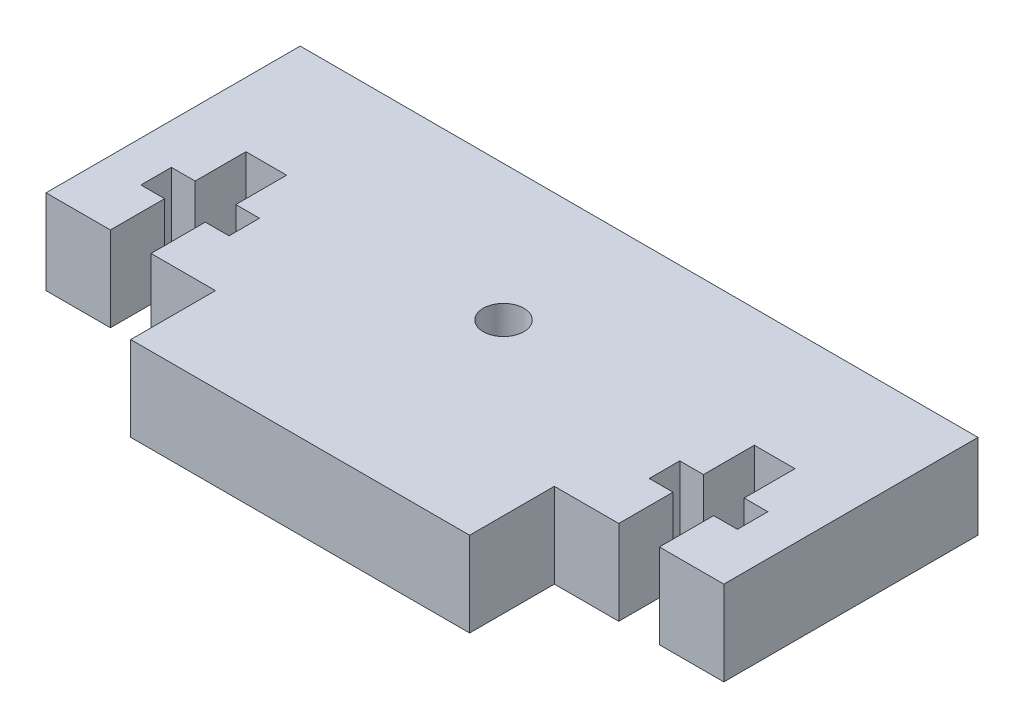
ISO-10303-21;
HEADER;
FILE_DESCRIPTION(('STEP AP214'),'2;1');
FILE_NAME('part.step','',(''),(''),'','','');
FILE_SCHEMA(('AUTOMOTIVE_DESIGN { 1 0 10303 214 1 1 1 1 }'));
ENDSEC;
DATA;
#1=APPLICATION_CONTEXT('core data for automotive mechanical design processes');
#2=APPLICATION_PROTOCOL_DEFINITION('international standard','automotive_design',2000,#1);
#3=PRODUCT_CONTEXT('',#1,'mechanical');
#4=PRODUCT('Part','Part','',(#3));
#5=PRODUCT_RELATED_PRODUCT_CATEGORY('part','',(#4));
#6=PRODUCT_DEFINITION_FORMATION('','',#4);
#7=PRODUCT_DEFINITION_CONTEXT('part definition',#1,'design');
#8=PRODUCT_DEFINITION('design','',#6,#7);
#9=PRODUCT_DEFINITION_SHAPE('','',#8);
#10=(LENGTH_UNIT() NAMED_UNIT(*) SI_UNIT(.MILLI.,.METRE.));
#11=(NAMED_UNIT(*) PLANE_ANGLE_UNIT() SI_UNIT($,.RADIAN.));
#12=(NAMED_UNIT(*) SI_UNIT($,.STERADIAN.) SOLID_ANGLE_UNIT());
#13=UNCERTAINTY_MEASURE_WITH_UNIT(LENGTH_MEASURE(1.E-05),#10,'distance_accuracy_value','');
#14=(GEOMETRIC_REPRESENTATION_CONTEXT(3) GLOBAL_UNCERTAINTY_ASSIGNED_CONTEXT((#13)) GLOBAL_UNIT_ASSIGNED_CONTEXT((#10,
#11,#12)) REPRESENTATION_CONTEXT('',''));
#15=CARTESIAN_POINT('',(0.,0.,0.));
#16=DIRECTION('',(0.,0.,1.));
#17=DIRECTION('',(1.,0.,0.));
#18=AXIS2_PLACEMENT_3D('',#15,#16,#17);
#19=CARTESIAN_POINT('',(0.,6.35,25.4));
#20=DIRECTION('',(0.,0.,-1.));
#21=DIRECTION('',(-1.,0.,0.));
#22=AXIS2_PLACEMENT_3D('',#19,#20,#21);
#23=PLANE('',#22);
#24=DIRECTION('',(1.,0.,0.));
#25=VECTOR('',#24,1.);
#26=CARTESIAN_POINT('',(0.,0.,25.4));
#27=LINE('',#26,#25);
#28=CARTESIAN_POINT('',(12.7,0.,25.4));
#29=VERTEX_POINT('',#28);
#30=CARTESIAN_POINT('',(38.1,0.,25.4));
#31=VERTEX_POINT('',#30);
#32=EDGE_CURVE('E337',#29,#31,#27,.T.);
#33=ORIENTED_EDGE('',*,*,#32,.T.);
#34=DIRECTION('',(0.,-1.,0.));
#35=VECTOR('',#34,1.);
#36=CARTESIAN_POINT('',(38.1,6.35,25.4));
#37=LINE('',#36,#35);
#38=CARTESIAN_POINT('',(38.1,6.35,25.4));
#39=VERTEX_POINT('',#38);
#40=EDGE_CURVE('E11',#39,#31,#37,.T.);
#41=ORIENTED_EDGE('',*,*,#40,.F.);
#42=DIRECTION('',(1.,0.,0.));
#43=VECTOR('',#42,1.);
#44=CARTESIAN_POINT('',(0.,6.35,25.4));
#45=LINE('',#44,#43);
#46=CARTESIAN_POINT('',(12.7,6.35,25.4));
#47=VERTEX_POINT('',#46);
#48=EDGE_CURVE('E329',#47,#39,#45,.T.);
#49=ORIENTED_EDGE('',*,*,#48,.F.);
#50=DIRECTION('',(0.,-1.,0.));
#51=VECTOR('',#50,1.);
#52=CARTESIAN_POINT('',(12.7,6.35,25.4));
#53=LINE('',#52,#51);
#54=EDGE_CURVE('E48',#47,#29,#53,.T.);
#55=ORIENTED_EDGE('',*,*,#54,.T.);
#56=EDGE_LOOP('',(#33,#41,#49,#55));
#57=FACE_BOUND('',#56,.T.);
#58=ADVANCED_FACE('F32',(#57),#23,.F.);
#59=CARTESIAN_POINT('',(38.1,6.35,0.));
#60=DIRECTION('',(-1.,0.,0.));
#61=DIRECTION('',(0.,0.,1.));
#62=AXIS2_PLACEMENT_3D('',#59,#60,#61);
#63=PLANE('',#62);
#64=DIRECTION('',(0.,0.,-1.));
#65=VECTOR('',#64,1.);
#66=CARTESIAN_POINT('',(38.1,0.,0.));
#67=LINE('',#66,#65);
#68=CARTESIAN_POINT('',(38.1,0.,19.05));
#69=VERTEX_POINT('',#68);
#70=EDGE_CURVE('E340',#31,#69,#67,.T.);
#71=ORIENTED_EDGE('',*,*,#70,.T.);
#72=DIRECTION('',(0.,-1.,0.));
#73=VECTOR('',#72,1.);
#74=CARTESIAN_POINT('',(38.1,6.35,19.05));
#75=LINE('',#74,#73);
#76=CARTESIAN_POINT('',(38.1,6.35,19.05));
#77=VERTEX_POINT('',#76);
#78=EDGE_CURVE('E40',#77,#69,#75,.T.);
#79=ORIENTED_EDGE('',*,*,#78,.F.);
#80=DIRECTION('',(0.,0.,-1.));
#81=VECTOR('',#80,1.);
#82=CARTESIAN_POINT('',(38.1,6.35,0.));
#83=LINE('',#82,#81);
#84=EDGE_CURVE('E159',#39,#77,#83,.T.);
#85=ORIENTED_EDGE('',*,*,#84,.F.);
#86=ORIENTED_EDGE('',*,*,#40,.T.);
#87=EDGE_LOOP('',(#71,#79,#85,#86));
#88=FACE_BOUND('',#87,.T.);
#89=ADVANCED_FACE('F475',(#88),#63,.F.);
#90=CARTESIAN_POINT('',(0.,6.35,19.05));
#91=DIRECTION('',(0.,0.,1.));
#92=DIRECTION('',(1.,0.,0.));
#93=AXIS2_PLACEMENT_3D('',#90,#91,#92);
#94=PLANE('',#93);
#95=DIRECTION('',(-1.,0.,0.));
#96=VECTOR('',#95,1.);
#97=CARTESIAN_POINT('',(0.,0.,19.05));
#98=LINE('',#97,#96);
#99=CARTESIAN_POINT('',(42.926,0.,19.05));
#100=VERTEX_POINT('',#99);
#101=EDGE_CURVE('E344',#100,#69,#98,.T.);
#102=ORIENTED_EDGE('',*,*,#101,.F.);
#103=DIRECTION('',(0.,-1.,0.));
#104=VECTOR('',#103,1.);
#105=CARTESIAN_POINT('',(42.926,6.35,19.05));
#106=LINE('',#105,#104);
#107=CARTESIAN_POINT('',(42.926,6.35,19.05));
#108=VERTEX_POINT('',#107);
#109=EDGE_CURVE('E470',#108,#100,#106,.T.);
#110=ORIENTED_EDGE('',*,*,#109,.F.);
#111=DIRECTION('',(-1.,0.,0.));
#112=VECTOR('',#111,1.);
#113=CARTESIAN_POINT('',(0.,6.35,19.05));
#114=LINE('',#113,#112);
#115=EDGE_CURVE('E325',#108,#77,#114,.T.);
#116=ORIENTED_EDGE('',*,*,#115,.T.);
#117=ORIENTED_EDGE('',*,*,#78,.T.);
#118=EDGE_LOOP('',(#102,#110,#116,#117));
#119=FACE_BOUND('',#118,.T.);
#120=ADVANCED_FACE('F473',(#119),#94,.T.);
#121=CARTESIAN_POINT('',(42.926,6.35,0.));
#122=DIRECTION('',(-1.,0.,0.));
#123=DIRECTION('',(0.,0.,1.));
#124=AXIS2_PLACEMENT_3D('',#121,#122,#123);
#125=PLANE('',#124);
#126=DIRECTION('',(0.,0.,-1.));
#127=VECTOR('',#126,1.);
#128=CARTESIAN_POINT('',(42.926,0.,0.));
#129=LINE('',#128,#127);
#130=CARTESIAN_POINT('',(42.926,0.,14.986));
#131=VERTEX_POINT('',#130);
#132=EDGE_CURVE('E350',#100,#131,#129,.T.);
#133=ORIENTED_EDGE('',*,*,#132,.T.);
#134=DIRECTION('',(0.,-1.,0.));
#135=VECTOR('',#134,1.);
#136=CARTESIAN_POINT('',(42.926,6.35,14.986));
#137=LINE('',#136,#135);
#138=CARTESIAN_POINT('',(42.926,6.35,14.986));
#139=VERTEX_POINT('',#138);
#140=EDGE_CURVE('E468',#139,#131,#137,.T.);
#141=ORIENTED_EDGE('',*,*,#140,.F.);
#142=DIRECTION('',(0.,0.,-1.));
#143=VECTOR('',#142,1.);
#144=CARTESIAN_POINT('',(42.926,6.35,0.));
#145=LINE('',#144,#143);
#146=EDGE_CURVE('E323',#108,#139,#145,.T.);
#147=ORIENTED_EDGE('',*,*,#146,.F.);
#148=ORIENTED_EDGE('',*,*,#109,.T.);
#149=EDGE_LOOP('',(#133,#141,#147,#148));
#150=FACE_BOUND('',#149,.T.);
#151=ADVANCED_FACE('F482',(#150),#125,.F.);
#152=CARTESIAN_POINT('',(0.,6.35,14.986));
#153=DIRECTION('',(0.,0.,-1.));
#154=DIRECTION('',(-1.,0.,0.));
#155=AXIS2_PLACEMENT_3D('',#152,#153,#154);
#156=PLANE('',#155);
#157=DIRECTION('',(1.,0.,0.));
#158=VECTOR('',#157,1.);
#159=CARTESIAN_POINT('',(0.,0.,14.986));
#160=LINE('',#159,#158);
#161=CARTESIAN_POINT('',(41.148,0.,14.986));
#162=VERTEX_POINT('',#161);
#163=EDGE_CURVE('E354',#162,#131,#160,.T.);
#164=ORIENTED_EDGE('',*,*,#163,.F.);
#165=DIRECTION('',(0.,-1.,0.));
#166=VECTOR('',#165,1.);
#167=CARTESIAN_POINT('',(41.148,6.35,14.986));
#168=LINE('',#167,#166);
#169=CARTESIAN_POINT('',(41.148,6.35,14.986));
#170=VERTEX_POINT('',#169);
#171=EDGE_CURVE('E466',#170,#162,#168,.T.);
#172=ORIENTED_EDGE('',*,*,#171,.F.);
#173=DIRECTION('',(1.,0.,0.));
#174=VECTOR('',#173,1.);
#175=CARTESIAN_POINT('',(0.,6.35,14.986));
#176=LINE('',#175,#174);
#177=EDGE_CURVE('E320',#170,#139,#176,.T.);
#178=ORIENTED_EDGE('',*,*,#177,.T.);
#179=ORIENTED_EDGE('',*,*,#140,.T.);
#180=EDGE_LOOP('',(#164,#172,#178,#179));
#181=FACE_BOUND('',#180,.T.);
#182=ADVANCED_FACE('F499',(#181),#156,.T.);
#183=CARTESIAN_POINT('',(41.148,6.35,0.));
#184=DIRECTION('',(1.,0.,0.));
#185=DIRECTION('',(0.,0.,-1.));
#186=AXIS2_PLACEMENT_3D('',#183,#184,#185);
#187=PLANE('',#186);
#188=DIRECTION('',(0.,0.,1.));
#189=VECTOR('',#188,1.);
#190=CARTESIAN_POINT('',(41.148,0.,0.));
#191=LINE('',#190,#189);
#192=CARTESIAN_POINT('',(41.148,0.,12.7));
#193=VERTEX_POINT('',#192);
#194=EDGE_CURVE('E358',#193,#162,#191,.T.);
#195=ORIENTED_EDGE('',*,*,#194,.F.);
#196=DIRECTION('',(0.,-1.,0.));
#197=VECTOR('',#196,1.);
#198=CARTESIAN_POINT('',(41.148,6.35,12.7));
#199=LINE('',#198,#197);
#200=CARTESIAN_POINT('',(41.148,6.35,12.7));
#201=VERTEX_POINT('',#200);
#202=EDGE_CURVE('E464',#201,#193,#199,.T.);
#203=ORIENTED_EDGE('',*,*,#202,.F.);
#204=DIRECTION('',(0.,0.,1.));
#205=VECTOR('',#204,1.);
#206=CARTESIAN_POINT('',(41.148,6.35,0.));
#207=LINE('',#206,#205);
#208=EDGE_CURVE('E317',#201,#170,#207,.T.);
#209=ORIENTED_EDGE('',*,*,#208,.T.);
#210=ORIENTED_EDGE('',*,*,#171,.T.);
#211=EDGE_LOOP('',(#195,#203,#209,#210));
#212=FACE_BOUND('',#211,.T.);
#213=ADVANCED_FACE('F495',(#212),#187,.T.);
#214=CARTESIAN_POINT('',(0.,6.35,12.7));
#215=DIRECTION('',(0.,0.,-1.));
#216=DIRECTION('',(-1.,0.,0.));
#217=AXIS2_PLACEMENT_3D('',#214,#215,#216);
#218=PLANE('',#217);
#219=DIRECTION('',(1.,0.,0.));
#220=VECTOR('',#219,1.);
#221=CARTESIAN_POINT('',(0.,0.,12.7));
#222=LINE('',#221,#220);
#223=CARTESIAN_POINT('',(42.926,0.,12.7));
#224=VERTEX_POINT('',#223);
#225=EDGE_CURVE('E362',#193,#224,#222,.T.);
#226=ORIENTED_EDGE('',*,*,#225,.T.);
#227=DIRECTION('',(0.,-1.,0.));
#228=VECTOR('',#227,1.);
#229=CARTESIAN_POINT('',(42.926,6.35,12.7));
#230=LINE('',#229,#228);
#231=CARTESIAN_POINT('',(42.926,6.35,12.7));
#232=VERTEX_POINT('',#231);
#233=EDGE_CURVE('E461',#232,#224,#230,.T.);
#234=ORIENTED_EDGE('',*,*,#233,.F.);
#235=DIRECTION('',(1.,0.,0.));
#236=VECTOR('',#235,1.);
#237=CARTESIAN_POINT('',(0.,6.35,12.7));
#238=LINE('',#237,#236);
#239=EDGE_CURVE('E315',#201,#232,#238,.T.);
#240=ORIENTED_EDGE('',*,*,#239,.F.);
#241=ORIENTED_EDGE('',*,*,#202,.T.);
#242=EDGE_LOOP('',(#226,#234,#240,#241));
#243=FACE_BOUND('',#242,.T.);
#244=ADVANCED_FACE('F498',(#243),#218,.F.);
#245=CARTESIAN_POINT('',(42.926,0.,8.89));
#246=VERTEX_POINT('',#245);
#247=EDGE_CURVE('E355',#224,#246,#129,.T.);
#248=ORIENTED_EDGE('',*,*,#247,.T.);
#249=DIRECTION('',(0.,-1.,0.));
#250=VECTOR('',#249,1.);
#251=CARTESIAN_POINT('',(42.926,6.35,8.89));
#252=LINE('',#251,#250);
#253=CARTESIAN_POINT('',(42.926,6.35,8.89));
#254=VERTEX_POINT('',#253);
#255=EDGE_CURVE('E458',#254,#246,#252,.T.);
#256=ORIENTED_EDGE('',*,*,#255,.F.);
#257=EDGE_CURVE('E314',#232,#254,#145,.T.);
#258=ORIENTED_EDGE('',*,*,#257,.F.);
#259=ORIENTED_EDGE('',*,*,#233,.T.);
#260=EDGE_LOOP('',(#248,#256,#258,#259));
#261=FACE_BOUND('',#260,.T.);
#262=ADVANCED_FACE('F501',(#261),#125,.F.);
#263=CARTESIAN_POINT('',(0.,6.35,8.89));
#264=DIRECTION('',(0.,0.,-1.));
#265=DIRECTION('',(-1.,0.,0.));
#266=AXIS2_PLACEMENT_3D('',#263,#264,#265);
#267=PLANE('',#266);
#268=DIRECTION('',(1.,0.,0.));
#269=VECTOR('',#268,1.);
#270=CARTESIAN_POINT('',(0.,0.,8.89));
#271=LINE('',#270,#269);
#272=CARTESIAN_POINT('',(45.974,0.,8.89));
#273=VERTEX_POINT('',#272);
#274=EDGE_CURVE('E365',#246,#273,#271,.T.);
#275=ORIENTED_EDGE('',*,*,#274,.T.);
#276=DIRECTION('',(0.,-1.,0.));
#277=VECTOR('',#276,1.);
#278=CARTESIAN_POINT('',(45.974,6.35,8.89));
#279=LINE('',#278,#277);
#280=CARTESIAN_POINT('',(45.974,6.35,8.89));
#281=VERTEX_POINT('',#280);
#282=EDGE_CURVE('E456',#281,#273,#279,.T.);
#283=ORIENTED_EDGE('',*,*,#282,.F.);
#284=DIRECTION('',(1.,0.,0.));
#285=VECTOR('',#284,1.);
#286=CARTESIAN_POINT('',(0.,6.35,8.89));
#287=LINE('',#286,#285);
#288=EDGE_CURVE('E311',#254,#281,#287,.T.);
#289=ORIENTED_EDGE('',*,*,#288,.F.);
#290=ORIENTED_EDGE('',*,*,#255,.T.);
#291=EDGE_LOOP('',(#275,#283,#289,#290));
#292=FACE_BOUND('',#291,.T.);
#293=ADVANCED_FACE('F504',(#292),#267,.F.);
#294=CARTESIAN_POINT('',(45.974,6.35,0.));
#295=DIRECTION('',(-1.,0.,0.));
#296=DIRECTION('',(0.,0.,1.));
#297=AXIS2_PLACEMENT_3D('',#294,#295,#296);
#298=PLANE('',#297);
#299=DIRECTION('',(0.,0.,-1.));
#300=VECTOR('',#299,1.);
#301=CARTESIAN_POINT('',(45.974,0.,0.));
#302=LINE('',#301,#300);
#303=CARTESIAN_POINT('',(45.974,0.,12.7));
#304=VERTEX_POINT('',#303);
#305=EDGE_CURVE('E368',#304,#273,#302,.T.);
#306=ORIENTED_EDGE('',*,*,#305,.F.);
#307=DIRECTION('',(0.,-1.,0.));
#308=VECTOR('',#307,1.);
#309=CARTESIAN_POINT('',(45.974,6.35,12.7));
#310=LINE('',#309,#308);
#311=CARTESIAN_POINT('',(45.974,6.35,12.7));
#312=VERTEX_POINT('',#311);
#313=EDGE_CURVE('E454',#312,#304,#310,.T.);
#314=ORIENTED_EDGE('',*,*,#313,.F.);
#315=DIRECTION('',(0.,0.,-1.));
#316=VECTOR('',#315,1.);
#317=CARTESIAN_POINT('',(45.974,6.35,0.));
#318=LINE('',#317,#316);
#319=EDGE_CURVE('E308',#312,#281,#318,.T.);
#320=ORIENTED_EDGE('',*,*,#319,.T.);
#321=ORIENTED_EDGE('',*,*,#282,.T.);
#322=EDGE_LOOP('',(#306,#314,#320,#321));
#323=FACE_BOUND('',#322,.T.);
#324=ADVANCED_FACE('F508',(#323),#298,.T.);
#325=CARTESIAN_POINT('',(47.752,0.,12.7));
#326=VERTEX_POINT('',#325);
#327=EDGE_CURVE('E364',#304,#326,#222,.T.);
#328=ORIENTED_EDGE('',*,*,#327,.T.);
#329=DIRECTION('',(0.,-1.,0.));
#330=VECTOR('',#329,1.);
#331=CARTESIAN_POINT('',(47.752,6.35,12.7));
#332=LINE('',#331,#330);
#333=CARTESIAN_POINT('',(47.752,6.35,12.7));
#334=VERTEX_POINT('',#333);
#335=EDGE_CURVE('E451',#334,#326,#332,.T.);
#336=ORIENTED_EDGE('',*,*,#335,.F.);
#337=EDGE_CURVE('E307',#312,#334,#238,.T.);
#338=ORIENTED_EDGE('',*,*,#337,.F.);
#339=ORIENTED_EDGE('',*,*,#313,.T.);
#340=EDGE_LOOP('',(#328,#336,#338,#339));
#341=FACE_BOUND('',#340,.T.);
#342=ADVANCED_FACE('F510',(#341),#218,.F.);
#343=CARTESIAN_POINT('',(47.752,6.35,0.));
#344=DIRECTION('',(1.,0.,0.));
#345=DIRECTION('',(0.,0.,-1.));
#346=AXIS2_PLACEMENT_3D('',#343,#344,#345);
#347=PLANE('',#346);
#348=DIRECTION('',(0.,0.,1.));
#349=VECTOR('',#348,1.);
#350=CARTESIAN_POINT('',(47.752,0.,0.));
#351=LINE('',#350,#349);
#352=CARTESIAN_POINT('',(47.752,0.,14.986));
#353=VERTEX_POINT('',#352);
#354=EDGE_CURVE('E372',#326,#353,#351,.T.);
#355=ORIENTED_EDGE('',*,*,#354,.T.);
#356=DIRECTION('',(0.,-1.,0.));
#357=VECTOR('',#356,1.);
#358=CARTESIAN_POINT('',(47.752,6.35,14.986));
#359=LINE('',#358,#357);
#360=CARTESIAN_POINT('',(47.752,6.35,14.986));
#361=VERTEX_POINT('',#360);
#362=EDGE_CURVE('E449',#361,#353,#359,.T.);
#363=ORIENTED_EDGE('',*,*,#362,.F.);
#364=DIRECTION('',(0.,0.,1.));
#365=VECTOR('',#364,1.);
#366=CARTESIAN_POINT('',(47.752,6.35,0.));
#367=LINE('',#366,#365);
#368=EDGE_CURVE('E304',#334,#361,#367,.T.);
#369=ORIENTED_EDGE('',*,*,#368,.F.);
#370=ORIENTED_EDGE('',*,*,#335,.T.);
#371=EDGE_LOOP('',(#355,#363,#369,#370));
#372=FACE_BOUND('',#371,.T.);
#373=ADVANCED_FACE('F513',(#372),#347,.F.);
#374=CARTESIAN_POINT('',(45.974,0.,14.986));
#375=VERTEX_POINT('',#374);
#376=EDGE_CURVE('E359',#375,#353,#160,.T.);
#377=ORIENTED_EDGE('',*,*,#376,.F.);
#378=DIRECTION('',(0.,-1.,0.));
#379=VECTOR('',#378,1.);
#380=CARTESIAN_POINT('',(45.974,6.35,14.986));
#381=LINE('',#380,#379);
#382=CARTESIAN_POINT('',(45.974,6.35,14.986));
#383=VERTEX_POINT('',#382);
#384=EDGE_CURVE('E447',#383,#375,#381,.T.);
#385=ORIENTED_EDGE('',*,*,#384,.F.);
#386=EDGE_CURVE('E306',#383,#361,#176,.T.);
#387=ORIENTED_EDGE('',*,*,#386,.T.);
#388=ORIENTED_EDGE('',*,*,#362,.T.);
#389=EDGE_LOOP('',(#377,#385,#387,#388));
#390=FACE_BOUND('',#389,.T.);
#391=ADVANCED_FACE('F517',(#390),#156,.T.);
#392=CARTESIAN_POINT('',(45.974,0.,19.05));
#393=VERTEX_POINT('',#392);
#394=EDGE_CURVE('E371',#393,#375,#302,.T.);
#395=ORIENTED_EDGE('',*,*,#394,.F.);
#396=DIRECTION('',(0.,-1.,0.));
#397=VECTOR('',#396,1.);
#398=CARTESIAN_POINT('',(45.974,6.35,19.05));
#399=LINE('',#398,#397);
#400=CARTESIAN_POINT('',(45.974,6.35,19.05));
#401=VERTEX_POINT('',#400);
#402=EDGE_CURVE('E445',#401,#393,#399,.T.);
#403=ORIENTED_EDGE('',*,*,#402,.F.);
#404=EDGE_CURVE('E312',#401,#383,#318,.T.);
#405=ORIENTED_EDGE('',*,*,#404,.T.);
#406=ORIENTED_EDGE('',*,*,#384,.T.);
#407=EDGE_LOOP('',(#395,#403,#405,#406));
#408=FACE_BOUND('',#407,.T.);
#409=ADVANCED_FACE('F521',(#408),#298,.T.);
#410=CARTESIAN_POINT('',(50.8,0.,19.05));
#411=VERTEX_POINT('',#410);
#412=EDGE_CURVE('E351',#411,#393,#98,.T.);
#413=ORIENTED_EDGE('',*,*,#412,.F.);
#414=DIRECTION('',(0.,-1.,0.));
#415=VECTOR('',#414,1.);
#416=CARTESIAN_POINT('',(50.8,6.35,19.05));
#417=LINE('',#416,#415);
#418=CARTESIAN_POINT('',(50.8,6.35,19.05));
#419=VERTEX_POINT('',#418);
#420=EDGE_CURVE('E443',#419,#411,#417,.T.);
#421=ORIENTED_EDGE('',*,*,#420,.F.);
#422=EDGE_CURVE('E303',#419,#401,#114,.T.);
#423=ORIENTED_EDGE('',*,*,#422,.T.);
#424=ORIENTED_EDGE('',*,*,#402,.T.);
#425=EDGE_LOOP('',(#413,#421,#423,#424));
#426=FACE_BOUND('',#425,.T.);
#427=ADVANCED_FACE('F493',(#426),#94,.T.);
#428=CARTESIAN_POINT('',(50.8,6.35,0.));
#429=DIRECTION('',(1.,0.,0.));
#430=DIRECTION('',(0.,0.,-1.));
#431=AXIS2_PLACEMENT_3D('',#428,#429,#430);
#432=PLANE('',#431);
#433=DIRECTION('',(0.,0.,1.));
#434=VECTOR('',#433,1.);
#435=CARTESIAN_POINT('',(50.8,0.,0.));
#436=LINE('',#435,#434);
#437=CARTESIAN_POINT('',(50.8,0.,0.));
#438=VERTEX_POINT('',#437);
#439=EDGE_CURVE('E375',#438,#411,#436,.T.);
#440=ORIENTED_EDGE('',*,*,#439,.F.);
#441=DIRECTION('',(0.,-1.,0.));
#442=VECTOR('',#441,1.);
#443=CARTESIAN_POINT('',(50.8,6.35,0.));
#444=LINE('',#443,#442);
#445=CARTESIAN_POINT('',(50.8,6.35,0.));
#446=VERTEX_POINT('',#445);
#447=EDGE_CURVE('E441',#446,#438,#444,.T.);
#448=ORIENTED_EDGE('',*,*,#447,.F.);
#449=DIRECTION('',(0.,0.,1.));
#450=VECTOR('',#449,1.);
#451=CARTESIAN_POINT('',(50.8,6.35,0.));
#452=LINE('',#451,#450);
#453=EDGE_CURVE('E300',#446,#419,#452,.T.);
#454=ORIENTED_EDGE('',*,*,#453,.T.);
#455=ORIENTED_EDGE('',*,*,#420,.T.);
#456=EDGE_LOOP('',(#440,#448,#454,#455));
#457=FACE_BOUND('',#456,.T.);
#458=ADVANCED_FACE('F527',(#457),#432,.T.);
#459=CARTESIAN_POINT('',(0.,6.35,0.));
#460=DIRECTION('',(0.,0.,-1.));
#461=DIRECTION('',(-1.,0.,0.));
#462=AXIS2_PLACEMENT_3D('',#459,#460,#461);
#463=PLANE('',#462);
#464=DIRECTION('',(1.,0.,0.));
#465=VECTOR('',#464,1.);
#466=CARTESIAN_POINT('',(0.,0.,0.));
#467=LINE('',#466,#465);
#468=CARTESIAN_POINT('',(0.,0.,0.));
#469=VERTEX_POINT('',#468);
#470=EDGE_CURVE('E378',#469,#438,#467,.T.);
#471=ORIENTED_EDGE('',*,*,#470,.F.);
#472=DIRECTION('',(0.,-1.,0.));
#473=VECTOR('',#472,1.);
#474=CARTESIAN_POINT('',(0.,6.35,0.));
#475=LINE('',#474,#473);
#476=CARTESIAN_POINT('',(0.,6.35,0.));
#477=VERTEX_POINT('',#476);
#478=EDGE_CURVE('E439',#477,#469,#475,.T.);
#479=ORIENTED_EDGE('',*,*,#478,.F.);
#480=DIRECTION('',(1.,0.,0.));
#481=VECTOR('',#480,1.);
#482=CARTESIAN_POINT('',(0.,6.35,0.));
#483=LINE('',#482,#481);
#484=EDGE_CURVE('E297',#477,#446,#483,.T.);
#485=ORIENTED_EDGE('',*,*,#484,.T.);
#486=ORIENTED_EDGE('',*,*,#447,.T.);
#487=EDGE_LOOP('',(#471,#479,#485,#486));
#488=FACE_BOUND('',#487,.T.);
#489=ADVANCED_FACE('F531',(#488),#463,.T.);
#490=CARTESIAN_POINT('',(0.,6.35,0.));
#491=DIRECTION('',(1.,0.,0.));
#492=DIRECTION('',(0.,0.,-1.));
#493=AXIS2_PLACEMENT_3D('',#490,#491,#492);
#494=PLANE('',#493);
#495=DIRECTION('',(0.,0.,1.));
#496=VECTOR('',#495,1.);
#497=CARTESIAN_POINT('',(0.,0.,0.));
#498=LINE('',#497,#496);
#499=CARTESIAN_POINT('',(0.,0.,19.05));
#500=VERTEX_POINT('',#499);
#501=EDGE_CURVE('E381',#469,#500,#498,.T.);
#502=ORIENTED_EDGE('',*,*,#501,.T.);
#503=DIRECTION('',(0.,-1.,0.));
#504=VECTOR('',#503,1.);
#505=CARTESIAN_POINT('',(0.,6.35,19.05));
#506=LINE('',#505,#504);
#507=CARTESIAN_POINT('',(0.,6.35,19.05));
#508=VERTEX_POINT('',#507);
#509=EDGE_CURVE('E436',#508,#500,#506,.T.);
#510=ORIENTED_EDGE('',*,*,#509,.F.);
#511=DIRECTION('',(0.,0.,1.));
#512=VECTOR('',#511,1.);
#513=CARTESIAN_POINT('',(0.,6.35,0.));
#514=LINE('',#513,#512);
#515=EDGE_CURVE('E295',#477,#508,#514,.T.);
#516=ORIENTED_EDGE('',*,*,#515,.F.);
#517=ORIENTED_EDGE('',*,*,#478,.T.);
#518=EDGE_LOOP('',(#502,#510,#516,#517));
#519=FACE_BOUND('',#518,.T.);
#520=ADVANCED_FACE('F535',(#519),#494,.F.);
#521=CARTESIAN_POINT('',(0.,6.35,19.05));
#522=DIRECTION('',(0.,0.,-1.));
#523=DIRECTION('',(-1.,0.,0.));
#524=AXIS2_PLACEMENT_3D('',#521,#522,#523);
#525=PLANE('',#524);
#526=DIRECTION('',(1.,0.,0.));
#527=VECTOR('',#526,1.);
#528=CARTESIAN_POINT('',(0.,0.,19.05));
#529=LINE('',#528,#527);
#530=CARTESIAN_POINT('',(4.826,0.,19.05));
#531=VERTEX_POINT('',#530);
#532=EDGE_CURVE('E383',#500,#531,#529,.T.);
#533=ORIENTED_EDGE('',*,*,#532,.T.);
#534=DIRECTION('',(0.,-1.,0.));
#535=VECTOR('',#534,1.);
#536=CARTESIAN_POINT('',(4.826,6.35,19.05));
#537=LINE('',#536,#535);
#538=CARTESIAN_POINT('',(4.826,6.35,19.05));
#539=VERTEX_POINT('',#538);
#540=EDGE_CURVE('E433',#539,#531,#537,.T.);
#541=ORIENTED_EDGE('',*,*,#540,.F.);
#542=DIRECTION('',(1.,0.,0.));
#543=VECTOR('',#542,1.);
#544=CARTESIAN_POINT('',(0.,6.35,19.05));
#545=LINE('',#544,#543);
#546=EDGE_CURVE('E264',#508,#539,#545,.T.);
#547=ORIENTED_EDGE('',*,*,#546,.F.);
#548=ORIENTED_EDGE('',*,*,#509,.T.);
#549=EDGE_LOOP('',(#533,#541,#547,#548));
#550=FACE_BOUND('',#549,.T.);
#551=ADVANCED_FACE('F539',(#550),#525,.F.);
#552=CARTESIAN_POINT('',(4.826,6.35,0.));
#553=DIRECTION('',(-1.,0.,0.));
#554=DIRECTION('',(0.,0.,1.));
#555=AXIS2_PLACEMENT_3D('',#552,#553,#554);
#556=PLANE('',#555);
#557=DIRECTION('',(0.,0.,-1.));
#558=VECTOR('',#557,1.);
#559=CARTESIAN_POINT('',(4.826,0.,0.));
#560=LINE('',#559,#558);
#561=CARTESIAN_POINT('',(4.826,0.,14.986));
#562=VERTEX_POINT('',#561);
#563=EDGE_CURVE('E385',#531,#562,#560,.T.);
#564=ORIENTED_EDGE('',*,*,#563,.T.);
#565=DIRECTION('',(0.,-1.,0.));
#566=VECTOR('',#565,1.);
#567=CARTESIAN_POINT('',(4.826,6.35,14.986));
#568=LINE('',#567,#566);
#569=CARTESIAN_POINT('',(4.826,6.35,14.986));
#570=VERTEX_POINT('',#569);
#571=EDGE_CURVE('E430',#570,#562,#568,.T.);
#572=ORIENTED_EDGE('',*,*,#571,.F.);
#573=DIRECTION('',(0.,0.,-1.));
#574=VECTOR('',#573,1.);
#575=CARTESIAN_POINT('',(4.826,6.35,0.));
#576=LINE('',#575,#574);
#577=EDGE_CURVE('E289',#539,#570,#576,.T.);
#578=ORIENTED_EDGE('',*,*,#577,.F.);
#579=ORIENTED_EDGE('',*,*,#540,.T.);
#580=EDGE_LOOP('',(#564,#572,#578,#579));
#581=FACE_BOUND('',#580,.T.);
#582=ADVANCED_FACE('F552',(#581),#556,.F.);
#583=CARTESIAN_POINT('',(0.,6.35,14.986));
#584=DIRECTION('',(0.,0.,1.));
#585=DIRECTION('',(1.,0.,0.));
#586=AXIS2_PLACEMENT_3D('',#583,#584,#585);
#587=PLANE('',#586);
#588=DIRECTION('',(-1.,0.,0.));
#589=VECTOR('',#588,1.);
#590=CARTESIAN_POINT('',(0.,0.,14.986));
#591=LINE('',#590,#589);
#592=CARTESIAN_POINT('',(3.04799999999999,0.,14.986));
#593=VERTEX_POINT('',#592);
#594=EDGE_CURVE('E388',#562,#593,#591,.T.);
#595=ORIENTED_EDGE('',*,*,#594,.T.);
#596=DIRECTION('',(0.,-1.,0.));
#597=VECTOR('',#596,1.);
#598=CARTESIAN_POINT('',(3.04799999999999,6.35,14.986));
#599=LINE('',#598,#597);
#600=CARTESIAN_POINT('',(3.04799999999999,6.35,14.986));
#601=VERTEX_POINT('',#600);
#602=EDGE_CURVE('E428',#601,#593,#599,.T.);
#603=ORIENTED_EDGE('',*,*,#602,.F.);
#604=DIRECTION('',(-1.,0.,0.));
#605=VECTOR('',#604,1.);
#606=CARTESIAN_POINT('',(0.,6.35,14.986));
#607=LINE('',#606,#605);
#608=EDGE_CURVE('E273',#570,#601,#607,.T.);
#609=ORIENTED_EDGE('',*,*,#608,.F.);
#610=ORIENTED_EDGE('',*,*,#571,.T.);
#611=EDGE_LOOP('',(#595,#603,#609,#610));
#612=FACE_BOUND('',#611,.T.);
#613=ADVANCED_FACE('F545',(#612),#587,.F.);
#614=CARTESIAN_POINT('',(3.04799999999999,6.35,0.));
#615=DIRECTION('',(1.,0.,0.));
#616=DIRECTION('',(0.,0.,-1.));
#617=AXIS2_PLACEMENT_3D('',#614,#615,#616);
#618=PLANE('',#617);
#619=DIRECTION('',(0.,0.,1.));
#620=VECTOR('',#619,1.);
#621=CARTESIAN_POINT('',(3.04799999999999,0.,0.));
#622=LINE('',#621,#620);
#623=CARTESIAN_POINT('',(3.04799999999999,0.,12.7));
#624=VERTEX_POINT('',#623);
#625=EDGE_CURVE('E392',#624,#593,#622,.T.);
#626=ORIENTED_EDGE('',*,*,#625,.F.);
#627=DIRECTION('',(0.,-1.,0.));
#628=VECTOR('',#627,1.);
#629=CARTESIAN_POINT('',(3.04799999999999,6.35,12.7));
#630=LINE('',#629,#628);
#631=CARTESIAN_POINT('',(3.04799999999999,6.35,12.7));
#632=VERTEX_POINT('',#631);
#633=EDGE_CURVE('E426',#632,#624,#630,.T.);
#634=ORIENTED_EDGE('',*,*,#633,.F.);
#635=DIRECTION('',(0.,0.,1.));
#636=VECTOR('',#635,1.);
#637=CARTESIAN_POINT('',(3.04799999999999,6.35,0.));
#638=LINE('',#637,#636);
#639=EDGE_CURVE('E292',#632,#601,#638,.T.);
#640=ORIENTED_EDGE('',*,*,#639,.T.);
#641=ORIENTED_EDGE('',*,*,#602,.T.);
#642=EDGE_LOOP('',(#626,#634,#640,#641));
#643=FACE_BOUND('',#642,.T.);
#644=ADVANCED_FACE('F541',(#643),#618,.T.);
#645=CARTESIAN_POINT('',(0.,6.35,12.7));
#646=DIRECTION('',(0.,0.,1.));
#647=DIRECTION('',(1.,0.,0.));
#648=AXIS2_PLACEMENT_3D('',#645,#646,#647);
#649=PLANE('',#648);
#650=DIRECTION('',(-1.,0.,0.));
#651=VECTOR('',#650,1.);
#652=CARTESIAN_POINT('',(0.,0.,12.7));
#653=LINE('',#652,#651);
#654=CARTESIAN_POINT('',(4.826,0.,12.7));
#655=VERTEX_POINT('',#654);
#656=EDGE_CURVE('E396',#655,#624,#653,.T.);
#657=ORIENTED_EDGE('',*,*,#656,.F.);
#658=DIRECTION('',(0.,-1.,0.));
#659=VECTOR('',#658,1.);
#660=CARTESIAN_POINT('',(4.826,6.35,12.7));
#661=LINE('',#660,#659);
#662=CARTESIAN_POINT('',(4.826,6.35,12.7));
#663=VERTEX_POINT('',#662);
#664=EDGE_CURVE('E424',#663,#655,#661,.T.);
#665=ORIENTED_EDGE('',*,*,#664,.F.);
#666=DIRECTION('',(-1.,0.,0.));
#667=VECTOR('',#666,1.);
#668=CARTESIAN_POINT('',(0.,6.35,12.7));
#669=LINE('',#668,#667);
#670=EDGE_CURVE('E283',#663,#632,#669,.T.);
#671=ORIENTED_EDGE('',*,*,#670,.T.);
#672=ORIENTED_EDGE('',*,*,#633,.T.);
#673=EDGE_LOOP('',(#657,#665,#671,#672));
#674=FACE_BOUND('',#673,.T.);
#675=ADVANCED_FACE('F544',(#674),#649,.T.);
#676=CARTESIAN_POINT('',(4.826,0.,8.89000000000001));
#677=VERTEX_POINT('',#676);
#678=EDGE_CURVE('E389',#655,#677,#560,.T.);
#679=ORIENTED_EDGE('',*,*,#678,.T.);
#680=DIRECTION('',(0.,-1.,0.));
#681=VECTOR('',#680,1.);
#682=CARTESIAN_POINT('',(4.826,6.35,8.89000000000001));
#683=LINE('',#682,#681);
#684=CARTESIAN_POINT('',(4.826,6.35,8.89000000000001));
#685=VERTEX_POINT('',#684);
#686=EDGE_CURVE('E422',#685,#677,#683,.T.);
#687=ORIENTED_EDGE('',*,*,#686,.F.);
#688=EDGE_CURVE('E285',#663,#685,#576,.T.);
#689=ORIENTED_EDGE('',*,*,#688,.F.);
#690=ORIENTED_EDGE('',*,*,#664,.T.);
#691=EDGE_LOOP('',(#679,#687,#689,#690));
#692=FACE_BOUND('',#691,.T.);
#693=ADVANCED_FACE('F547',(#692),#556,.F.);
#694=CARTESIAN_POINT('',(0.,6.35,8.89000000000001));
#695=DIRECTION('',(0.,0.,1.));
#696=DIRECTION('',(1.,0.,0.));
#697=AXIS2_PLACEMENT_3D('',#694,#695,#696);
#698=PLANE('',#697);
#699=DIRECTION('',(-1.,0.,0.));
#700=VECTOR('',#699,1.);
#701=CARTESIAN_POINT('',(0.,0.,8.89000000000001));
#702=LINE('',#701,#700);
#703=CARTESIAN_POINT('',(7.874,0.,8.89));
#704=VERTEX_POINT('',#703);
#705=EDGE_CURVE('E400',#704,#677,#702,.T.);
#706=ORIENTED_EDGE('',*,*,#705,.F.);
#707=DIRECTION('',(0.,-1.,0.));
#708=VECTOR('',#707,1.);
#709=CARTESIAN_POINT('',(7.874,6.35,8.89));
#710=LINE('',#709,#708);
#711=CARTESIAN_POINT('',(7.874,6.35,8.89));
#712=VERTEX_POINT('',#711);
#713=EDGE_CURVE('E420',#712,#704,#710,.T.);
#714=ORIENTED_EDGE('',*,*,#713,.F.);
#715=DIRECTION('',(-1.,0.,0.));
#716=VECTOR('',#715,1.);
#717=CARTESIAN_POINT('',(0.,6.35,8.89000000000001));
#718=LINE('',#717,#716);
#719=EDGE_CURVE('E278',#712,#685,#718,.T.);
#720=ORIENTED_EDGE('',*,*,#719,.T.);
#721=ORIENTED_EDGE('',*,*,#686,.T.);
#722=EDGE_LOOP('',(#706,#714,#720,#721));
#723=FACE_BOUND('',#722,.T.);
#724=ADVANCED_FACE('F550',(#723),#698,.T.);
#725=CARTESIAN_POINT('',(7.87399999999999,6.35,0.));
#726=DIRECTION('',(-1.,0.,0.));
#727=DIRECTION('',(0.,0.,1.));
#728=AXIS2_PLACEMENT_3D('',#725,#726,#727);
#729=PLANE('',#728);
#730=DIRECTION('',(0.,0.,-1.));
#731=VECTOR('',#730,1.);
#732=CARTESIAN_POINT('',(7.87399999999999,0.,0.));
#733=LINE('',#732,#731);
#734=CARTESIAN_POINT('',(7.874,0.,12.7));
#735=VERTEX_POINT('',#734);
#736=EDGE_CURVE('E403',#735,#704,#733,.T.);
#737=ORIENTED_EDGE('',*,*,#736,.F.);
#738=DIRECTION('',(0.,-1.,0.));
#739=VECTOR('',#738,1.);
#740=CARTESIAN_POINT('',(7.874,6.35,12.7));
#741=LINE('',#740,#739);
#742=CARTESIAN_POINT('',(7.874,6.35,12.7));
#743=VERTEX_POINT('',#742);
#744=EDGE_CURVE('E418',#743,#735,#741,.T.);
#745=ORIENTED_EDGE('',*,*,#744,.F.);
#746=DIRECTION('',(0.,0.,-1.));
#747=VECTOR('',#746,1.);
#748=CARTESIAN_POINT('',(7.87399999999999,6.35,0.));
#749=LINE('',#748,#747);
#750=EDGE_CURVE('E270',#743,#712,#749,.T.);
#751=ORIENTED_EDGE('',*,*,#750,.T.);
#752=ORIENTED_EDGE('',*,*,#713,.T.);
#753=EDGE_LOOP('',(#737,#745,#751,#752));
#754=FACE_BOUND('',#753,.T.);
#755=ADVANCED_FACE('F555',(#754),#729,.T.);
#756=CARTESIAN_POINT('',(9.65200000000001,0.,12.7));
#757=VERTEX_POINT('',#756);
#758=EDGE_CURVE('E399',#757,#735,#653,.T.);
#759=ORIENTED_EDGE('',*,*,#758,.F.);
#760=DIRECTION('',(0.,-1.,0.));
#761=VECTOR('',#760,1.);
#762=CARTESIAN_POINT('',(9.65200000000001,6.35,12.7));
#763=LINE('',#762,#761);
#764=CARTESIAN_POINT('',(9.65200000000001,6.35,12.7));
#765=VERTEX_POINT('',#764);
#766=EDGE_CURVE('E416',#765,#757,#763,.T.);
#767=ORIENTED_EDGE('',*,*,#766,.F.);
#768=EDGE_CURVE('E277',#765,#743,#669,.T.);
#769=ORIENTED_EDGE('',*,*,#768,.T.);
#770=ORIENTED_EDGE('',*,*,#744,.T.);
#771=EDGE_LOOP('',(#759,#767,#769,#770));
#772=FACE_BOUND('',#771,.T.);
#773=ADVANCED_FACE('F556',(#772),#649,.T.);
#774=CARTESIAN_POINT('',(9.65200000000001,6.35,0.));
#775=DIRECTION('',(1.,0.,0.));
#776=DIRECTION('',(0.,0.,-1.));
#777=AXIS2_PLACEMENT_3D('',#774,#775,#776);
#778=PLANE('',#777);
#779=DIRECTION('',(0.,0.,1.));
#780=VECTOR('',#779,1.);
#781=CARTESIAN_POINT('',(9.65200000000001,0.,0.));
#782=LINE('',#781,#780);
#783=CARTESIAN_POINT('',(9.65200000000001,0.,14.986));
#784=VERTEX_POINT('',#783);
#785=EDGE_CURVE('E406',#757,#784,#782,.T.);
#786=ORIENTED_EDGE('',*,*,#785,.T.);
#787=DIRECTION('',(0.,-1.,0.));
#788=VECTOR('',#787,1.);
#789=CARTESIAN_POINT('',(9.65200000000001,6.35,14.986));
#790=LINE('',#789,#788);
#791=CARTESIAN_POINT('',(9.65200000000001,6.35,14.986));
#792=VERTEX_POINT('',#791);
#793=EDGE_CURVE('E413',#792,#784,#790,.T.);
#794=ORIENTED_EDGE('',*,*,#793,.F.);
#795=DIRECTION('',(0.,0.,1.));
#796=VECTOR('',#795,1.);
#797=CARTESIAN_POINT('',(9.65200000000001,6.35,0.));
#798=LINE('',#797,#796);
#799=EDGE_CURVE('E271',#765,#792,#798,.T.);
#800=ORIENTED_EDGE('',*,*,#799,.F.);
#801=ORIENTED_EDGE('',*,*,#766,.T.);
#802=EDGE_LOOP('',(#786,#794,#800,#801));
#803=FACE_BOUND('',#802,.T.);
#804=ADVANCED_FACE('F559',(#803),#778,.F.);
#805=CARTESIAN_POINT('',(7.874,0.,14.986));
#806=VERTEX_POINT('',#805);
#807=EDGE_CURVE('E393',#784,#806,#591,.T.);
#808=ORIENTED_EDGE('',*,*,#807,.T.);
#809=DIRECTION('',(0.,-1.,0.));
#810=VECTOR('',#809,1.);
#811=CARTESIAN_POINT('',(7.874,6.35,14.986));
#812=LINE('',#811,#810);
#813=CARTESIAN_POINT('',(7.874,6.35,14.986));
#814=VERTEX_POINT('',#813);
#815=EDGE_CURVE('E256',#814,#806,#812,.T.);
#816=ORIENTED_EDGE('',*,*,#815,.F.);
#817=EDGE_CURVE('E267',#792,#814,#607,.T.);
#818=ORIENTED_EDGE('',*,*,#817,.F.);
#819=ORIENTED_EDGE('',*,*,#793,.T.);
#820=EDGE_LOOP('',(#808,#816,#818,#819));
#821=FACE_BOUND('',#820,.T.);
#822=ADVANCED_FACE('F563',(#821),#587,.F.);
#823=CARTESIAN_POINT('',(7.87400000000001,0.,19.05));
#824=VERTEX_POINT('',#823);
#825=EDGE_CURVE('E253',#824,#806,#733,.T.);
#826=ORIENTED_EDGE('',*,*,#825,.F.);
#827=DIRECTION('',(0.,-1.,0.));
#828=VECTOR('',#827,1.);
#829=CARTESIAN_POINT('',(7.87400000000001,6.35,19.05));
#830=LINE('',#829,#828);
#831=CARTESIAN_POINT('',(7.87400000000001,6.35,19.05));
#832=VERTEX_POINT('',#831);
#833=EDGE_CURVE('E247',#832,#824,#830,.T.);
#834=ORIENTED_EDGE('',*,*,#833,.F.);
#835=EDGE_CURVE('E251',#832,#814,#749,.T.);
#836=ORIENTED_EDGE('',*,*,#835,.T.);
#837=ORIENTED_EDGE('',*,*,#815,.T.);
#838=EDGE_LOOP('',(#826,#834,#836,#837));
#839=FACE_BOUND('',#838,.T.);
#840=ADVANCED_FACE('F249',(#839),#729,.T.);
#841=CARTESIAN_POINT('',(12.7,0.,19.05));
#842=VERTEX_POINT('',#841);
#843=EDGE_CURVE('E386',#824,#842,#529,.T.);
#844=ORIENTED_EDGE('',*,*,#843,.T.);
#845=DIRECTION('',(0.,-1.,0.));
#846=VECTOR('',#845,1.);
#847=CARTESIAN_POINT('',(12.7,6.35,19.05));
#848=LINE('',#847,#846);
#849=CARTESIAN_POINT('',(12.7,6.35,19.05));
#850=VERTEX_POINT('',#849);
#851=EDGE_CURVE('E147',#850,#842,#848,.T.);
#852=ORIENTED_EDGE('',*,*,#851,.F.);
#853=EDGE_CURVE('E258',#832,#850,#545,.T.);
#854=ORIENTED_EDGE('',*,*,#853,.F.);
#855=ORIENTED_EDGE('',*,*,#833,.T.);
#856=EDGE_LOOP('',(#844,#852,#854,#855));
#857=FACE_BOUND('',#856,.T.);
#858=ADVANCED_FACE('F259',(#857),#525,.F.);
#859=CARTESIAN_POINT('',(12.7,6.35,0.));
#860=DIRECTION('',(-1.,0.,0.));
#861=DIRECTION('',(0.,0.,1.));
#862=AXIS2_PLACEMENT_3D('',#859,#860,#861);
#863=PLANE('',#862);
#864=DIRECTION('',(0.,0.,-1.));
#865=VECTOR('',#864,1.);
#866=CARTESIAN_POINT('',(12.7,0.,0.));
#867=LINE('',#866,#865);
#868=EDGE_CURVE('E331',#29,#842,#867,.T.);
#869=ORIENTED_EDGE('',*,*,#868,.F.);
#870=ORIENTED_EDGE('',*,*,#54,.F.);
#871=DIRECTION('',(0.,0.,-1.));
#872=VECTOR('',#871,1.);
#873=CARTESIAN_POINT('',(12.7,6.35,0.));
#874=LINE('',#873,#872);
#875=EDGE_CURVE('E262',#47,#850,#874,.T.);
#876=ORIENTED_EDGE('',*,*,#875,.T.);
#877=ORIENTED_EDGE('',*,*,#851,.T.);
#878=EDGE_LOOP('',(#869,#870,#876,#877));
#879=FACE_BOUND('',#878,.T.);
#880=ADVANCED_FACE('F572',(#879),#863,.T.);
#881=CARTESIAN_POINT('',(0.,6.35,0.));
#882=DIRECTION('',(0.,1.,0.));
#883=DIRECTION('',(0.,0.,1.));
#884=AXIS2_PLACEMENT_3D('',#881,#882,#883);
#885=PLANE('',#884);
#886=CARTESIAN_POINT('',(25.4,6.35,10.16));
#887=DIRECTION('',(0.,1.,0.));
#888=DIRECTION('',(0.,0.,1.));
#889=AXIS2_PLACEMENT_3D('',#886,#887,#888);
#890=CIRCLE('',#889,1.524);
#891=CARTESIAN_POINT('',(25.4,6.35,11.684));
#892=VERTEX_POINT('',#891);
#893=EDGE_CURVE('E332',#892,#892,#890,.T.);
#894=ORIENTED_EDGE('',*,*,#893,.F.);
#895=EDGE_LOOP('',(#894));
#896=FACE_BOUND('',#895,.T.);
#897=ORIENTED_EDGE('',*,*,#48,.T.);
#898=ORIENTED_EDGE('',*,*,#84,.T.);
#899=ORIENTED_EDGE('',*,*,#115,.F.);
#900=ORIENTED_EDGE('',*,*,#146,.T.);
#901=ORIENTED_EDGE('',*,*,#177,.F.);
#902=ORIENTED_EDGE('',*,*,#208,.F.);
#903=ORIENTED_EDGE('',*,*,#239,.T.);
#904=ORIENTED_EDGE('',*,*,#257,.T.);
#905=ORIENTED_EDGE('',*,*,#288,.T.);
#906=ORIENTED_EDGE('',*,*,#319,.F.);
#907=ORIENTED_EDGE('',*,*,#337,.T.);
#908=ORIENTED_EDGE('',*,*,#368,.T.);
#909=ORIENTED_EDGE('',*,*,#386,.F.);
#910=ORIENTED_EDGE('',*,*,#404,.F.);
#911=ORIENTED_EDGE('',*,*,#422,.F.);
#912=ORIENTED_EDGE('',*,*,#453,.F.);
#913=ORIENTED_EDGE('',*,*,#484,.F.);
#914=ORIENTED_EDGE('',*,*,#515,.T.);
#915=ORIENTED_EDGE('',*,*,#546,.T.);
#916=ORIENTED_EDGE('',*,*,#577,.T.);
#917=ORIENTED_EDGE('',*,*,#608,.T.);
#918=ORIENTED_EDGE('',*,*,#639,.F.);
#919=ORIENTED_EDGE('',*,*,#670,.F.);
#920=ORIENTED_EDGE('',*,*,#688,.T.);
#921=ORIENTED_EDGE('',*,*,#719,.F.);
#922=ORIENTED_EDGE('',*,*,#750,.F.);
#923=ORIENTED_EDGE('',*,*,#768,.F.);
#924=ORIENTED_EDGE('',*,*,#799,.T.);
#925=ORIENTED_EDGE('',*,*,#817,.T.);
#926=ORIENTED_EDGE('',*,*,#835,.F.);
#927=ORIENTED_EDGE('',*,*,#853,.T.);
#928=ORIENTED_EDGE('',*,*,#875,.F.);
#929=EDGE_LOOP('',(#897,#898,#899,#900,#901,#902,#903,#904,#905,#906,#907,#908,#909,#910,#911,
#912,#913,#914,#915,#916,#917,#918,#919,#920,#921,#922,#923,#924,#925,#926,#927,#928));
#930=FACE_BOUND('',#929,.T.);
#931=ADVANCED_FACE('F265',(#896,#930),#885,.T.);
#932=CARTESIAN_POINT('',(0.,0.,0.));
#933=DIRECTION('',(0.,1.,0.));
#934=DIRECTION('',(0.,0.,1.));
#935=AXIS2_PLACEMENT_3D('',#932,#933,#934);
#936=PLANE('',#935);
#937=CARTESIAN_POINT('',(25.4,0.,10.16));
#938=DIRECTION('',(0.,1.,0.));
#939=DIRECTION('',(0.,0.,1.));
#940=AXIS2_PLACEMENT_3D('',#937,#938,#939);
#941=CIRCLE('',#940,1.524);
#942=CARTESIAN_POINT('',(25.4,0.,11.684));
#943=VERTEX_POINT('',#942);
#944=EDGE_CURVE('E335',#943,#943,#941,.T.);
#945=ORIENTED_EDGE('',*,*,#944,.T.);
#946=EDGE_LOOP('',(#945));
#947=FACE_BOUND('',#946,.T.);
#948=ORIENTED_EDGE('',*,*,#32,.F.);
#949=ORIENTED_EDGE('',*,*,#868,.T.);
#950=ORIENTED_EDGE('',*,*,#843,.F.);
#951=ORIENTED_EDGE('',*,*,#825,.T.);
#952=ORIENTED_EDGE('',*,*,#807,.F.);
#953=ORIENTED_EDGE('',*,*,#785,.F.);
#954=ORIENTED_EDGE('',*,*,#758,.T.);
#955=ORIENTED_EDGE('',*,*,#736,.T.);
#956=ORIENTED_EDGE('',*,*,#705,.T.);
#957=ORIENTED_EDGE('',*,*,#678,.F.);
#958=ORIENTED_EDGE('',*,*,#656,.T.);
#959=ORIENTED_EDGE('',*,*,#625,.T.);
#960=ORIENTED_EDGE('',*,*,#594,.F.);
#961=ORIENTED_EDGE('',*,*,#563,.F.);
#962=ORIENTED_EDGE('',*,*,#532,.F.);
#963=ORIENTED_EDGE('',*,*,#501,.F.);
#964=ORIENTED_EDGE('',*,*,#470,.T.);
#965=ORIENTED_EDGE('',*,*,#439,.T.);
#966=ORIENTED_EDGE('',*,*,#412,.T.);
#967=ORIENTED_EDGE('',*,*,#394,.T.);
#968=ORIENTED_EDGE('',*,*,#376,.T.);
#969=ORIENTED_EDGE('',*,*,#354,.F.);
#970=ORIENTED_EDGE('',*,*,#327,.F.);
#971=ORIENTED_EDGE('',*,*,#305,.T.);
#972=ORIENTED_EDGE('',*,*,#274,.F.);
#973=ORIENTED_EDGE('',*,*,#247,.F.);
#974=ORIENTED_EDGE('',*,*,#225,.F.);
#975=ORIENTED_EDGE('',*,*,#194,.T.);
#976=ORIENTED_EDGE('',*,*,#163,.T.);
#977=ORIENTED_EDGE('',*,*,#132,.F.);
#978=ORIENTED_EDGE('',*,*,#101,.T.);
#979=ORIENTED_EDGE('',*,*,#70,.F.);
#980=EDGE_LOOP('',(#948,#949,#950,#951,#952,#953,#954,#955,#956,#957,#958,#959,#960,#961,#962,
#963,#964,#965,#966,#967,#968,#969,#970,#971,#972,#973,#974,#975,#976,#977,#978,#979));
#981=FACE_BOUND('',#980,.T.);
#982=ADVANCED_FACE('F478',(#947,#981),#936,.F.);
#983=CARTESIAN_POINT('',(25.4,0.,10.16));
#984=DIRECTION('',(0.,1.,0.));
#985=DIRECTION('',(0.,0.,1.));
#986=AXIS2_PLACEMENT_3D('',#983,#984,#985);
#987=CYLINDRICAL_SURFACE('',#986,1.524);
#988=ORIENTED_EDGE('',*,*,#944,.F.);
#989=EDGE_LOOP('',(#988));
#990=FACE_BOUND('',#989,.T.);
#991=ORIENTED_EDGE('',*,*,#893,.T.);
#992=EDGE_LOOP('',(#991));
#993=FACE_BOUND('',#992,.T.);
#994=ADVANCED_FACE('F577',(#990,#993),#987,.F.);
#995=CLOSED_SHELL('',(#58,#89,#120,#151,#182,#213,#244,#262,#293,#324,#342,#373,#391,#409,#427,
#458,#489,#520,#551,#582,#613,#644,#675,#693,#724,#755,#773,#804,#822,#840,#858,#880,#931,#982,#994));
#996=MANIFOLD_SOLID_BREP('B2',#995);
#997=ADVANCED_BREP_SHAPE_REPRESENTATION('',(#18,#996),#14);
#998=SHAPE_DEFINITION_REPRESENTATION(#9,#997);
ENDSEC;
END-ISO-10303-21;
